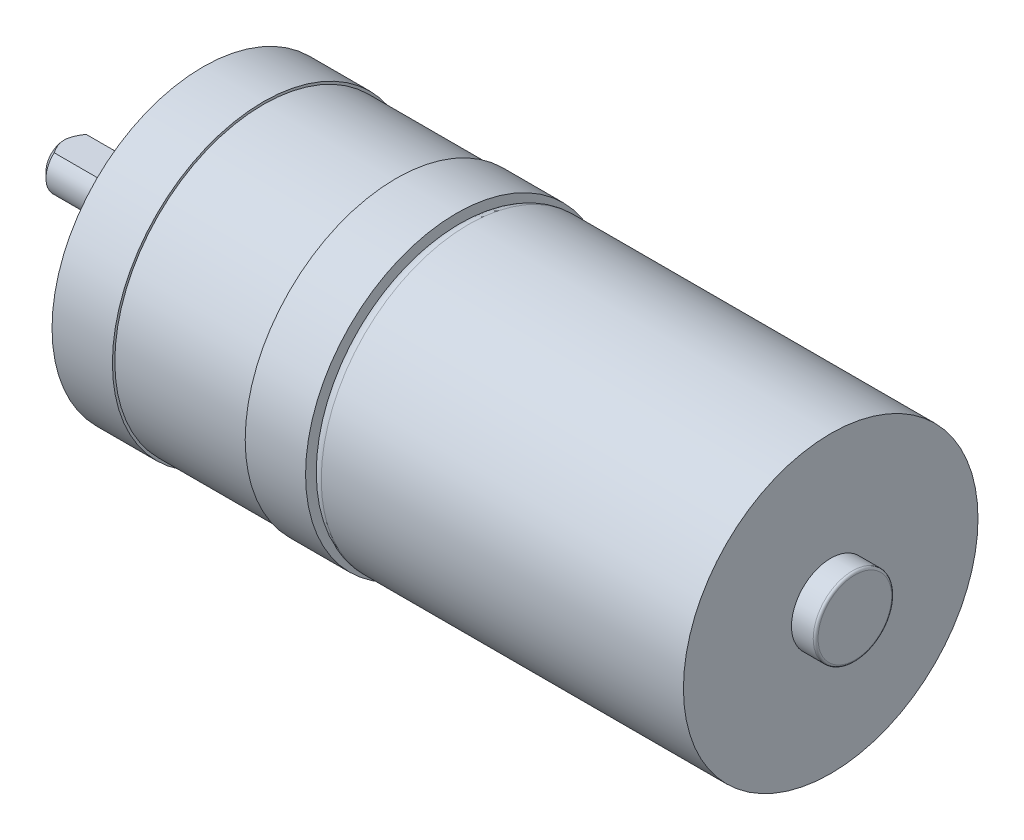
ISO-10303-21;
HEADER;
FILE_DESCRIPTION(('STEP AP214'),'2;1');
FILE_NAME('part.step','',(''),(''),'','','');
FILE_SCHEMA(('AUTOMOTIVE_DESIGN { 1 0 10303 214 1 1 1 1 }'));
ENDSEC;
DATA;
#1=APPLICATION_CONTEXT('core data for automotive mechanical design processes');
#2=APPLICATION_PROTOCOL_DEFINITION('international standard','automotive_design',2000,#1);
#3=PRODUCT_CONTEXT('',#1,'mechanical');
#4=PRODUCT('Part','Part','',(#3));
#5=PRODUCT_RELATED_PRODUCT_CATEGORY('part','',(#4));
#6=PRODUCT_DEFINITION_FORMATION('','',#4);
#7=PRODUCT_DEFINITION_CONTEXT('part definition',#1,'design');
#8=PRODUCT_DEFINITION('design','',#6,#7);
#9=PRODUCT_DEFINITION_SHAPE('','',#8);
#10=(LENGTH_UNIT() NAMED_UNIT(*) SI_UNIT(.MILLI.,.METRE.));
#11=(NAMED_UNIT(*) PLANE_ANGLE_UNIT() SI_UNIT($,.RADIAN.));
#12=(NAMED_UNIT(*) SI_UNIT($,.STERADIAN.) SOLID_ANGLE_UNIT());
#13=UNCERTAINTY_MEASURE_WITH_UNIT(LENGTH_MEASURE(1.E-05),#10,'distance_accuracy_value','');
#14=(GEOMETRIC_REPRESENTATION_CONTEXT(3) GLOBAL_UNCERTAINTY_ASSIGNED_CONTEXT((#13)) GLOBAL_UNIT_ASSIGNED_CONTEXT((#10,
#11,#12)) REPRESENTATION_CONTEXT('',''));
#15=CARTESIAN_POINT('',(0.,0.,0.));
#16=DIRECTION('',(0.,0.,1.));
#17=DIRECTION('',(1.,0.,0.));
#18=AXIS2_PLACEMENT_3D('',#15,#16,#17);
#19=CARTESIAN_POINT('',(-21.4466609261385,0.,0.));
#20=DIRECTION('',(-1.,0.,0.));
#21=DIRECTION('',(0.,0.,1.));
#22=AXIS2_PLACEMENT_3D('',#19,#20,#21);
#23=CYLINDRICAL_SURFACE('',#22,12.5);
#24=CARTESIAN_POINT('',(-4.94666092613853,0.,0.));
#25=DIRECTION('',(-1.,0.,0.));
#26=DIRECTION('',(0.,0.,1.));
#27=AXIS2_PLACEMENT_3D('',#24,#25,#26);
#28=CIRCLE('',#27,12.5);
#29=CARTESIAN_POINT('',(-4.94666092613853,0.,12.5));
#30=VERTEX_POINT('',#29);
#31=EDGE_CURVE('E113',#30,#30,#28,.T.);
#32=ORIENTED_EDGE('',*,*,#31,.T.);
#33=EDGE_LOOP('',(#32));
#34=FACE_BOUND('',#33,.T.);
#35=CARTESIAN_POINT('',(-9.94666092613853,0.,0.));
#36=DIRECTION('',(-1.,0.,0.));
#37=DIRECTION('',(0.,0.,1.));
#38=AXIS2_PLACEMENT_3D('',#35,#36,#37);
#39=CIRCLE('',#38,12.5);
#40=CARTESIAN_POINT('',(-9.94666092613853,0.,12.5));
#41=VERTEX_POINT('',#40);
#42=EDGE_CURVE('E11',#41,#41,#39,.T.);
#43=ORIENTED_EDGE('',*,*,#42,.F.);
#44=EDGE_LOOP('',(#43));
#45=FACE_BOUND('',#44,.T.);
#46=ADVANCED_FACE('F50',(#34,#45),#23,.T.);
#47=CARTESIAN_POINT('',(-9.94666092613853,-3.53165151629512,0.));
#48=DIRECTION('',(-1.,0.,0.));
#49=DIRECTION('',(0.,0.,1.));
#50=AXIS2_PLACEMENT_3D('',#47,#48,#49);
#51=PLANE('',#50);
#52=ORIENTED_EDGE('',*,*,#42,.T.);
#53=EDGE_LOOP('',(#52));
#54=FACE_BOUND('',#53,.T.);
#55=CARTESIAN_POINT('',(-9.94666092613853,0.,0.));
#56=DIRECTION('',(-1.,0.,0.));
#57=DIRECTION('',(0.,0.,1.));
#58=AXIS2_PLACEMENT_3D('',#55,#56,#57);
#59=CIRCLE('',#58,3.53165151629512);
#60=CARTESIAN_POINT('',(-9.94666092613853,0.,3.53165151629512));
#61=VERTEX_POINT('',#60);
#62=EDGE_CURVE('E58',#61,#61,#59,.T.);
#63=ORIENTED_EDGE('',*,*,#62,.F.);
#64=EDGE_LOOP('',(#63));
#65=FACE_BOUND('',#64,.T.);
#66=ADVANCED_FACE('F175',(#54,#65),#51,.T.);
#67=CARTESIAN_POINT('',(-21.4466609261385,0.,0.));
#68=DIRECTION('',(-1.,0.,0.));
#69=DIRECTION('',(0.,0.,1.));
#70=AXIS2_PLACEMENT_3D('',#67,#68,#69);
#71=CYLINDRICAL_SURFACE('',#70,3.53165151629512);
#72=ORIENTED_EDGE('',*,*,#62,.T.);
#73=EDGE_LOOP('',(#72));
#74=FACE_BOUND('',#73,.T.);
#75=CARTESIAN_POINT('',(-12.4466609261385,0.,0.));
#76=DIRECTION('',(-1.,0.,0.));
#77=DIRECTION('',(0.,0.,1.));
#78=AXIS2_PLACEMENT_3D('',#75,#76,#77);
#79=CIRCLE('',#78,3.53165151629512);
#80=CARTESIAN_POINT('',(-12.4466609261385,0.,3.53165151629512));
#81=VERTEX_POINT('',#80);
#82=EDGE_CURVE('E191',#81,#81,#79,.T.);
#83=ORIENTED_EDGE('',*,*,#82,.F.);
#84=EDGE_LOOP('',(#83));
#85=FACE_BOUND('',#84,.T.);
#86=ADVANCED_FACE('F180',(#74,#85),#71,.T.);
#87=CARTESIAN_POINT('',(-12.4466609261385,-2.,0.));
#88=DIRECTION('',(-1.,0.,0.));
#89=DIRECTION('',(0.,0.,1.));
#90=AXIS2_PLACEMENT_3D('',#87,#88,#89);
#91=PLANE('',#90);
#92=ORIENTED_EDGE('',*,*,#82,.T.);
#93=EDGE_LOOP('',(#92));
#94=FACE_BOUND('',#93,.T.);
#95=CARTESIAN_POINT('',(-12.4466609261385,0.,0.));
#96=DIRECTION('',(-1.,0.,0.));
#97=DIRECTION('',(0.,0.,1.));
#98=AXIS2_PLACEMENT_3D('',#95,#96,#97);
#99=CIRCLE('',#98,2.);
#100=CARTESIAN_POINT('',(-12.4466609261385,0.,2.));
#101=VERTEX_POINT('',#100);
#102=EDGE_CURVE('E196',#101,#101,#99,.T.);
#103=ORIENTED_EDGE('',*,*,#102,.F.);
#104=EDGE_LOOP('',(#103));
#105=FACE_BOUND('',#104,.T.);
#106=ADVANCED_FACE('F312',(#94,#105),#91,.T.);
#107=CARTESIAN_POINT('',(-21.4466609261385,0.,0.));
#108=DIRECTION('',(-1.,0.,0.));
#109=DIRECTION('',(0.,0.,1.));
#110=AXIS2_PLACEMENT_3D('',#107,#108,#109);
#111=CYLINDRICAL_SURFACE('',#110,2.);
#112=DIRECTION('',(-1.,0.,0.));
#113=VECTOR('',#112,1.);
#114=CARTESIAN_POINT('',(-13.4466609261385,1.5,1.3228756555323));
#115=LINE('',#114,#113);
#116=CARTESIAN_POINT('',(-13.4466609261385,1.5,1.3228756555323));
#117=VERTEX_POINT('',#116);
#118=CARTESIAN_POINT('',(-20.9466609261385,1.5,1.3228756555323));
#119=VERTEX_POINT('',#118);
#120=EDGE_CURVE('E90',#117,#119,#115,.T.);
#121=ORIENTED_EDGE('',*,*,#120,.T.);
#122=CARTESIAN_POINT('',(-20.9466609261385,0.,0.));
#123=DIRECTION('',(-1.,0.,0.));
#124=DIRECTION('',(0.,0.,1.));
#125=AXIS2_PLACEMENT_3D('',#122,#123,#124);
#126=CIRCLE('',#125,2.);
#127=CARTESIAN_POINT('',(-20.9466609261385,1.5,-1.3228756555323));
#128=VERTEX_POINT('',#127);
#129=EDGE_CURVE('E97',#128,#119,#126,.T.);
#130=ORIENTED_EDGE('',*,*,#129,.F.);
#131=DIRECTION('',(-1.,0.,0.));
#132=VECTOR('',#131,1.);
#133=CARTESIAN_POINT('',(-13.4466609261385,1.5,-1.3228756555323));
#134=LINE('',#133,#132);
#135=CARTESIAN_POINT('',(-13.4466609261385,1.5,-1.3228756555323));
#136=VERTEX_POINT('',#135);
#137=EDGE_CURVE('E89',#136,#128,#134,.T.);
#138=ORIENTED_EDGE('',*,*,#137,.F.);
#139=CARTESIAN_POINT('',(-13.4466609261385,0.,0.));
#140=DIRECTION('',(-1.,0.,0.));
#141=DIRECTION('',(0.,0.,1.));
#142=AXIS2_PLACEMENT_3D('',#139,#140,#141);
#143=CIRCLE('',#142,2.);
#144=EDGE_CURVE('E80',#117,#136,#143,.T.);
#145=ORIENTED_EDGE('',*,*,#144,.F.);
#146=EDGE_LOOP('',(#121,#130,#138,#145));
#147=FACE_BOUND('',#146,.T.);
#148=ORIENTED_EDGE('',*,*,#102,.T.);
#149=EDGE_LOOP('',(#148));
#150=FACE_BOUND('',#149,.T.);
#151=ADVANCED_FACE('F94',(#147,#150),#111,.T.);
#152=CARTESIAN_POINT('',(-21.4466609261385,0.,0.));
#153=DIRECTION('',(1.,0.,0.));
#154=DIRECTION('',(0.,0.,-1.));
#155=AXIS2_PLACEMENT_3D('',#152,#153,#154);
#156=CONICAL_SURFACE('',#155,1.5,0.785398163397448);
#157=CARTESIAN_POINT('',(-18.6599944301756,1.5,-4.01565805909955));
#158=CARTESIAN_POINT('',(-18.7772799339824,1.5,-3.89042013528773));
#159=CARTESIAN_POINT('',(-18.8942447324204,1.5,-3.76487746263411));
#160=CARTESIAN_POINT('',(-19.1272488522695,1.5,-3.51287496184868));
#161=CARTESIAN_POINT('',(-19.2432879191972,1.5,-3.38641489861014));
#162=CARTESIAN_POINT('',(-19.4750754185143,1.5,-3.13125567201492));
#163=CARTESIAN_POINT('',(-19.5908129825144,1.5,-3.00254661249287));
#164=CARTESIAN_POINT('',(-19.8204354842027,1.5,-2.74351946624489));
#165=CARTESIAN_POINT('',(-19.9343207337169,1.5,-2.61320165697772));
#166=CARTESIAN_POINT('',(-20.1398631331694,1.5,-2.37303010342155));
#167=CARTESIAN_POINT('',(-20.2319504655065,1.5,-2.26354611208234));
#168=CARTESIAN_POINT('',(-20.4134720299847,1.5,-2.04231590010789));
#169=CARTESIAN_POINT('',(-20.502905132972,1.5,-1.93056874975612));
#170=CARTESIAN_POINT('',(-20.6775427183617,1.5,-1.70415010582334));
#171=CARTESIAN_POINT('',(-20.7627558893309,1.5,-1.58948542537739));
#172=CARTESIAN_POINT('',(-20.8856244023833,1.5,-1.41406690474835));
#173=CARTESIAN_POINT('',(-20.9257433465697,1.5,-1.3550432048692));
#174=CARTESIAN_POINT('',(-21.0038206647526,1.5,-1.23558919260889));
#175=CARTESIAN_POINT('',(-21.0417794769346,1.5,-1.17515916903174));
#176=CARTESIAN_POINT('',(-21.1079330584043,1.5,-1.06419326243409));
#177=CARTESIAN_POINT('',(-21.1366159684713,1.5,-1.01394977892618));
#178=CARTESIAN_POINT('',(-21.1916094275951,1.5,-0.912163598634599));
#179=CARTESIAN_POINT('',(-21.2179196718334,1.5,-0.860620736003789));
#180=CARTESIAN_POINT('',(-21.2674843606524,1.5,-0.75613647512261));
#181=CARTESIAN_POINT('',(-21.2907422542188,1.5,-0.703196737968753));
#182=CARTESIAN_POINT('',(-21.3334168644819,1.5,-0.595812489744645));
#183=CARTESIAN_POINT('',(-21.3528347074981,1.5,-0.54136842526216));
#184=CARTESIAN_POINT('',(-21.3965857411879,1.5,-0.399362441578788));
#185=CARTESIAN_POINT('',(-21.4174026018075,1.5,-0.310627728461867));
#186=CARTESIAN_POINT('',(-21.4370271007536,1.5,-0.17600485397584));
#187=CARTESIAN_POINT('',(-21.4416363946779,1.5,-0.130926602570022));
#188=CARTESIAN_POINT('',(-21.4467900111874,1.5,-0.0405278937250137));
#189=CARTESIAN_POINT('',(-21.4473344618416,1.5,0.00479255603833192));
#190=CARTESIAN_POINT('',(-21.4443171872065,1.5,0.0953274395539691));
#191=CARTESIAN_POINT('',(-21.4407522873543,1.5,0.140541764268593));
#192=CARTESIAN_POINT('',(-21.4297122542497,1.5,0.230492359752381));
#193=CARTESIAN_POINT('',(-21.422236332384,1.5,0.275228532250461));
#194=CARTESIAN_POINT('',(-21.4037214360982,1.5,0.364085515861556));
#195=CARTESIAN_POINT('',(-21.3926720005498,1.5,0.408204118547307));
#196=CARTESIAN_POINT('',(-21.3674809164456,1.5,0.495536760983926));
#197=CARTESIAN_POINT('',(-21.35333922587,1.5,0.538750788434028));
#198=CARTESIAN_POINT('',(-21.3010753758268,1.5,0.683373717402224));
#199=CARTESIAN_POINT('',(-21.2568457909961,1.5,0.782575044372217));
#200=CARTESIAN_POINT('',(-21.1589248993358,1.5,0.976220616942044));
#201=CARTESIAN_POINT('',(-21.1052128657479,1.5,1.07065384672911));
#202=CARTESIAN_POINT('',(-20.9910249681587,1.5,1.25697315171939));
#203=CARTESIAN_POINT('',(-20.9304707236246,1.5,1.34881059342671));
#204=CARTESIAN_POINT('',(-20.8053465362851,1.5,1.52952998233961));
#205=CARTESIAN_POINT('',(-20.7407807001573,1.5,1.61841481358109));
#206=CARTESIAN_POINT('',(-20.5957213813144,1.5,1.81156206065232));
#207=CARTESIAN_POINT('',(-20.5146162537708,1.5,1.91536246677856));
#208=CARTESIAN_POINT('',(-20.3497178302725,1.5,2.12081369094374));
#209=CARTESIAN_POINT('',(-20.265924131741,1.5,2.2224641832459));
#210=CARTESIAN_POINT('',(-20.0963751354204,1.5,2.42427777545712));
#211=CARTESIAN_POINT('',(-20.0106180247746,1.5,2.52443934729585));
#212=CARTESIAN_POINT('',(-19.8377347485601,1.5,2.72357467383111));
#213=CARTESIAN_POINT('',(-19.7506085499926,1.5,2.82254839979564));
#214=CARTESIAN_POINT('',(-19.5806572523155,1.5,3.01359651876727));
#215=CARTESIAN_POINT('',(-19.4978925037317,1.5,3.10572469788864));
#216=CARTESIAN_POINT('',(-19.3316557364276,1.5,3.289343530319));
#217=CARTESIAN_POINT('',(-19.2481837030317,1.5,3.38083417032726));
#218=CARTESIAN_POINT('',(-19.0808466594457,1.5,3.56312044751085));
#219=CARTESIAN_POINT('',(-18.996982758081,1.5,3.65391710371256));
#220=CARTESIAN_POINT('',(-18.8288030047615,1.5,3.83508406846687));
#221=CARTESIAN_POINT('',(-18.7444871715748,1.5,3.92545439443569));
#222=CARTESIAN_POINT('',(-18.6599944301756,1.5,4.01565805909955));
#223=B_SPLINE_CURVE_WITH_KNOTS('',3,(#157,#158,#159,#160,#161,#162,#163,#164,#165,#166,#167,
#168,#169,#170,#171,#172,#173,#174,#175,#176,#177,#178,#179,#180,#181,#182,#183,#184,#185,#186,
#187,#188,#189,#190,#191,#192,#193,#194,#195,#196,#197,#198,#199,#200,#201,#202,#203,#204,#205,
#206,#207,#208,#209,#210,#211,#212,#213,#214,#215,#216,#217,#218,#219,#220,#221,#222),
.UNSPECIFIED.,.F.,.F.,(4,2,2,2,2,2,2,2,2,2,2,2,2,2,2,2,2,2,2,2,2,2,2,2,2,2,2,2,2,2,2,2,4),(0.,
0.514750699468764,1.02963833852691,1.54890574576718,2.06808481331768,2.49724068126467,
2.92657657581786,3.35498823243659,3.56905741024268,3.78308300790428,3.95659551745444,
4.13013028665268,4.30346725130455,4.47675329909123,4.74890512459737,4.8846880297537,
5.02046665684716,5.15635024622355,5.2922612455528,5.42857376872477,5.5648881443249,
5.88980547741524,6.2154420130272,6.54528321670252,6.87479215354149,7.2699099426123,
7.66508717383951,8.06064529972853,8.45621297429788,8.82774376861426,9.19928229096719,
9.57008337714151,9.94086918203867),.UNSPECIFIED.);
#224=CARTESIAN_POINT('',(-21.4466609261385,1.5,0.));
#225=VERTEX_POINT('',#224);
#226=EDGE_CURVE('E65',#128,#225,#223,.T.);
#227=ORIENTED_EDGE('',*,*,#226,.F.);
#228=ORIENTED_EDGE('',*,*,#129,.T.);
#229=EDGE_CURVE('E69',#225,#119,#223,.T.);
#230=ORIENTED_EDGE('',*,*,#229,.F.);
#231=CARTESIAN_POINT('',(-21.4466609261385,0.,0.));
#232=DIRECTION('',(-1.,0.,0.));
#233=DIRECTION('',(0.,0.,1.));
#234=AXIS2_PLACEMENT_3D('',#231,#232,#233);
#235=CIRCLE('',#234,1.5);
#236=EDGE_CURVE('E204',#225,#225,#235,.T.);
#237=ORIENTED_EDGE('',*,*,#236,.F.);
#238=EDGE_LOOP('',(#227,#228,#230,#237));
#239=FACE_BOUND('',#238,.T.);
#240=ADVANCED_FACE('F115',(#239),#156,.T.);
#241=CARTESIAN_POINT('',(-21.4466609261385,0.,0.));
#242=DIRECTION('',(-1.,0.,0.));
#243=DIRECTION('',(0.,0.,1.));
#244=AXIS2_PLACEMENT_3D('',#241,#242,#243);
#245=PLANE('',#244);
#246=ORIENTED_EDGE('',*,*,#236,.T.);
#247=EDGE_LOOP('',(#246));
#248=FACE_BOUND('',#247,.T.);
#249=ADVANCED_FACE('F165',(#248),#245,.T.);
#250=CARTESIAN_POINT('',(44.0533390738615,-3.05,0.));
#251=DIRECTION('',(1.,0.,0.));
#252=DIRECTION('',(0.,0.,-1.));
#253=AXIS2_PLACEMENT_3D('',#250,#251,#252);
#254=PLANE('',#253);
#255=CARTESIAN_POINT('',(44.0533390738615,0.,0.));
#256=DIRECTION('',(-1.,0.,0.));
#257=DIRECTION('',(0.,0.,1.));
#258=AXIS2_PLACEMENT_3D('',#255,#256,#257);
#259=CIRCLE('',#258,3.05);
#260=CARTESIAN_POINT('',(44.0533390738615,0.,3.05));
#261=VERTEX_POINT('',#260);
#262=EDGE_CURVE('E207',#261,#261,#259,.T.);
#263=ORIENTED_EDGE('',*,*,#262,.F.);
#264=EDGE_LOOP('',(#263));
#265=FACE_BOUND('',#264,.T.);
#266=ADVANCED_FACE('F162',(#265),#254,.T.);
#267=CARTESIAN_POINT('',(43.8533390738615,0.,0.));
#268=DIRECTION('',(-1.,0.,0.));
#269=DIRECTION('',(0.,0.,1.));
#270=AXIS2_PLACEMENT_3D('',#267,#268,#269);
#271=TOROIDAL_SURFACE('',#270,3.05,0.199999999999999);
#272=ORIENTED_EDGE('',*,*,#262,.T.);
#273=EDGE_LOOP('',(#272));
#274=FACE_BOUND('',#273,.T.);
#275=CARTESIAN_POINT('',(43.8533390738615,0.,0.));
#276=DIRECTION('',(-1.,0.,0.));
#277=DIRECTION('',(0.,0.,1.));
#278=AXIS2_PLACEMENT_3D('',#275,#276,#277);
#279=CIRCLE('',#278,3.25);
#280=CARTESIAN_POINT('',(43.8533390738615,0.,3.25));
#281=VERTEX_POINT('',#280);
#282=EDGE_CURVE('E211',#281,#281,#279,.T.);
#283=ORIENTED_EDGE('',*,*,#282,.F.);
#284=EDGE_LOOP('',(#283));
#285=FACE_BOUND('',#284,.T.);
#286=ADVANCED_FACE('F158',(#274,#285),#271,.T.);
#287=CARTESIAN_POINT('',(-21.4466609261385,0.,0.));
#288=DIRECTION('',(-1.,0.,0.));
#289=DIRECTION('',(0.,0.,1.));
#290=AXIS2_PLACEMENT_3D('',#287,#288,#289);
#291=CYLINDRICAL_SURFACE('',#290,3.25);
#292=ORIENTED_EDGE('',*,*,#282,.T.);
#293=EDGE_LOOP('',(#292));
#294=FACE_BOUND('',#293,.T.);
#295=CARTESIAN_POINT('',(42.0533390738615,0.,0.));
#296=DIRECTION('',(-1.,0.,0.));
#297=DIRECTION('',(0.,0.,1.));
#298=AXIS2_PLACEMENT_3D('',#295,#296,#297);
#299=CIRCLE('',#298,3.25);
#300=CARTESIAN_POINT('',(42.0533390738615,0.,3.25));
#301=VERTEX_POINT('',#300);
#302=EDGE_CURVE('E215',#301,#301,#299,.T.);
#303=ORIENTED_EDGE('',*,*,#302,.F.);
#304=EDGE_LOOP('',(#303));
#305=FACE_BOUND('',#304,.T.);
#306=ADVANCED_FACE('F154',(#294,#305),#291,.T.);
#307=CARTESIAN_POINT('',(42.0533390738615,-12.2,0.));
#308=DIRECTION('',(1.,0.,0.));
#309=DIRECTION('',(0.,0.,-1.));
#310=AXIS2_PLACEMENT_3D('',#307,#308,#309);
#311=PLANE('',#310);
#312=ORIENTED_EDGE('',*,*,#302,.T.);
#313=EDGE_LOOP('',(#312));
#314=FACE_BOUND('',#313,.T.);
#315=CARTESIAN_POINT('',(42.0533390738615,0.,0.));
#316=DIRECTION('',(-1.,0.,0.));
#317=DIRECTION('',(0.,0.,1.));
#318=AXIS2_PLACEMENT_3D('',#315,#316,#317);
#319=CIRCLE('',#318,12.2);
#320=CARTESIAN_POINT('',(42.0533390738615,0.,12.2));
#321=VERTEX_POINT('',#320);
#322=EDGE_CURVE('E219',#321,#321,#319,.T.);
#323=ORIENTED_EDGE('',*,*,#322,.F.);
#324=EDGE_LOOP('',(#323));
#325=FACE_BOUND('',#324,.T.);
#326=ADVANCED_FACE('F150',(#314,#325),#311,.T.);
#327=CARTESIAN_POINT('',(-21.4466609261385,0.,0.));
#328=DIRECTION('',(-1.,0.,0.));
#329=DIRECTION('',(0.,0.,1.));
#330=AXIS2_PLACEMENT_3D('',#327,#328,#329);
#331=CYLINDRICAL_SURFACE('',#330,12.2);
#332=ORIENTED_EDGE('',*,*,#322,.T.);
#333=EDGE_LOOP('',(#332));
#334=FACE_BOUND('',#333,.T.);
#335=CARTESIAN_POINT('',(12.0533390738614,0.,0.));
#336=DIRECTION('',(-1.,0.,0.));
#337=DIRECTION('',(0.,0.,1.));
#338=AXIS2_PLACEMENT_3D('',#335,#336,#337);
#339=CIRCLE('',#338,12.2);
#340=CARTESIAN_POINT('',(12.0533390738614,0.,12.2));
#341=VERTEX_POINT('',#340);
#342=EDGE_CURVE('E223',#341,#341,#339,.T.);
#343=ORIENTED_EDGE('',*,*,#342,.F.);
#344=EDGE_LOOP('',(#343));
#345=FACE_BOUND('',#344,.T.);
#346=ADVANCED_FACE('F146',(#334,#345),#331,.T.);
#347=CARTESIAN_POINT('',(12.0533390738614,0.,0.));
#348=DIRECTION('',(-1.,0.,0.));
#349=DIRECTION('',(0.,0.,1.));
#350=AXIS2_PLACEMENT_3D('',#347,#348,#349);
#351=TOROIDAL_SURFACE('',#350,11.2,1.);
#352=ORIENTED_EDGE('',*,*,#342,.T.);
#353=EDGE_LOOP('',(#352));
#354=FACE_BOUND('',#353,.T.);
#355=CARTESIAN_POINT('',(11.0533390738614,0.,0.));
#356=DIRECTION('',(-1.,0.,0.));
#357=DIRECTION('',(0.,0.,1.));
#358=AXIS2_PLACEMENT_3D('',#355,#356,#357);
#359=CIRCLE('',#358,11.2);
#360=CARTESIAN_POINT('',(11.0533390738614,0.,11.2));
#361=VERTEX_POINT('',#360);
#362=EDGE_CURVE('E227',#361,#361,#359,.T.);
#363=ORIENTED_EDGE('',*,*,#362,.F.);
#364=EDGE_LOOP('',(#363));
#365=FACE_BOUND('',#364,.T.);
#366=ADVANCED_FACE('F142',(#354,#365),#351,.T.);
#367=CARTESIAN_POINT('',(11.0533390738615,-11.2,0.));
#368=DIRECTION('',(1.,0.,0.));
#369=DIRECTION('',(0.,0.,-1.));
#370=AXIS2_PLACEMENT_3D('',#367,#368,#369);
#371=PLANE('',#370);
#372=ORIENTED_EDGE('',*,*,#362,.T.);
#373=EDGE_LOOP('',(#372));
#374=FACE_BOUND('',#373,.T.);
#375=CARTESIAN_POINT('',(11.0533390738615,0.,0.));
#376=DIRECTION('',(-1.,0.,0.));
#377=DIRECTION('',(0.,0.,1.));
#378=AXIS2_PLACEMENT_3D('',#375,#376,#377);
#379=CIRCLE('',#378,12.5);
#380=CARTESIAN_POINT('',(11.0533390738615,0.,12.5));
#381=VERTEX_POINT('',#380);
#382=EDGE_CURVE('E231',#381,#381,#379,.T.);
#383=ORIENTED_EDGE('',*,*,#382,.F.);
#384=EDGE_LOOP('',(#383));
#385=FACE_BOUND('',#384,.T.);
#386=ADVANCED_FACE('F138',(#374,#385),#371,.T.);
#387=CARTESIAN_POINT('',(-21.4466609261385,0.,0.));
#388=DIRECTION('',(-1.,0.,0.));
#389=DIRECTION('',(0.,0.,1.));
#390=AXIS2_PLACEMENT_3D('',#387,#388,#389);
#391=CYLINDRICAL_SURFACE('',#390,12.5);
#392=ORIENTED_EDGE('',*,*,#382,.T.);
#393=EDGE_LOOP('',(#392));
#394=FACE_BOUND('',#393,.T.);
#395=CARTESIAN_POINT('',(6.05333907386146,0.,0.));
#396=DIRECTION('',(-1.,0.,0.));
#397=DIRECTION('',(0.,0.,1.));
#398=AXIS2_PLACEMENT_3D('',#395,#396,#397);
#399=CIRCLE('',#398,12.5);
#400=CARTESIAN_POINT('',(6.05333907386146,0.,12.5));
#401=VERTEX_POINT('',#400);
#402=EDGE_CURVE('E235',#401,#401,#399,.T.);
#403=ORIENTED_EDGE('',*,*,#402,.F.);
#404=EDGE_LOOP('',(#403));
#405=FACE_BOUND('',#404,.T.);
#406=ADVANCED_FACE('F134',(#394,#405),#391,.T.);
#407=CARTESIAN_POINT('',(6.05333907386146,-12.3,0.));
#408=DIRECTION('',(-1.,0.,0.));
#409=DIRECTION('',(0.,0.,1.));
#410=AXIS2_PLACEMENT_3D('',#407,#408,#409);
#411=PLANE('',#410);
#412=ORIENTED_EDGE('',*,*,#402,.T.);
#413=EDGE_LOOP('',(#412));
#414=FACE_BOUND('',#413,.T.);
#415=CARTESIAN_POINT('',(6.05333907386146,0.,0.));
#416=DIRECTION('',(-1.,0.,0.));
#417=DIRECTION('',(0.,0.,1.));
#418=AXIS2_PLACEMENT_3D('',#415,#416,#417);
#419=CIRCLE('',#418,12.3);
#420=CARTESIAN_POINT('',(6.05333907386146,0.,12.3));
#421=VERTEX_POINT('',#420);
#422=EDGE_CURVE('E239',#421,#421,#419,.T.);
#423=ORIENTED_EDGE('',*,*,#422,.F.);
#424=EDGE_LOOP('',(#423));
#425=FACE_BOUND('',#424,.T.);
#426=ADVANCED_FACE('F130',(#414,#425),#411,.T.);
#427=CARTESIAN_POINT('',(-21.4466609261385,0.,0.));
#428=DIRECTION('',(-1.,0.,0.));
#429=DIRECTION('',(0.,0.,1.));
#430=AXIS2_PLACEMENT_3D('',#427,#428,#429);
#431=CYLINDRICAL_SURFACE('',#430,12.3);
#432=ORIENTED_EDGE('',*,*,#422,.T.);
#433=EDGE_LOOP('',(#432));
#434=FACE_BOUND('',#433,.T.);
#435=CARTESIAN_POINT('',(-4.94666092613853,0.,0.));
#436=DIRECTION('',(-1.,0.,0.));
#437=DIRECTION('',(0.,0.,1.));
#438=AXIS2_PLACEMENT_3D('',#435,#436,#437);
#439=CIRCLE('',#438,12.3);
#440=CARTESIAN_POINT('',(-4.94666092613853,0.,12.3));
#441=VERTEX_POINT('',#440);
#442=EDGE_CURVE('E242',#441,#441,#439,.T.);
#443=ORIENTED_EDGE('',*,*,#442,.F.);
#444=EDGE_LOOP('',(#443));
#445=FACE_BOUND('',#444,.T.);
#446=ADVANCED_FACE('F126',(#434,#445),#431,.T.);
#447=CARTESIAN_POINT('',(-4.94666092613853,-12.3,0.));
#448=DIRECTION('',(1.,0.,0.));
#449=DIRECTION('',(0.,0.,-1.));
#450=AXIS2_PLACEMENT_3D('',#447,#448,#449);
#451=PLANE('',#450);
#452=ORIENTED_EDGE('',*,*,#442,.T.);
#453=EDGE_LOOP('',(#452));
#454=FACE_BOUND('',#453,.T.);
#455=ORIENTED_EDGE('',*,*,#31,.F.);
#456=EDGE_LOOP('',(#455));
#457=FACE_BOUND('',#456,.T.);
#458=ADVANCED_FACE('F123',(#454,#457),#451,.T.);
#459=CARTESIAN_POINT('',(-13.4466609261385,1.5,-1.3228756555323));
#460=DIRECTION('',(0.,-1.,0.));
#461=DIRECTION('',(0.,0.,-1.));
#462=AXIS2_PLACEMENT_3D('',#459,#460,#461);
#463=PLANE('',#462);
#464=ORIENTED_EDGE('',*,*,#226,.T.);
#465=ORIENTED_EDGE('',*,*,#229,.T.);
#466=ORIENTED_EDGE('',*,*,#120,.F.);
#467=DIRECTION('',(0.,0.,1.));
#468=VECTOR('',#467,1.);
#469=CARTESIAN_POINT('',(-13.4466609261385,1.5,-1.3228756555323));
#470=LINE('',#469,#468);
#471=EDGE_CURVE('E83',#136,#117,#470,.T.);
#472=ORIENTED_EDGE('',*,*,#471,.F.);
#473=ORIENTED_EDGE('',*,*,#137,.T.);
#474=EDGE_LOOP('',(#464,#465,#466,#472,#473));
#475=FACE_BOUND('',#474,.T.);
#476=ADVANCED_FACE('F88',(#475),#463,.F.);
#477=CARTESIAN_POINT('',(-13.4466609261385,0.,0.));
#478=DIRECTION('',(-1.,0.,0.));
#479=DIRECTION('',(0.,0.,1.));
#480=AXIS2_PLACEMENT_3D('',#477,#478,#479);
#481=PLANE('',#480);
#482=ORIENTED_EDGE('',*,*,#144,.T.);
#483=ORIENTED_EDGE('',*,*,#471,.T.);
#484=EDGE_LOOP('',(#482,#483));
#485=FACE_BOUND('',#484,.T.);
#486=ADVANCED_FACE('F82',(#485),#481,.T.);
#487=CLOSED_SHELL('',(#46,#66,#86,#106,#151,#240,#249,#266,#286,#306,#326,#346,#366,#386,#406,
#426,#446,#458,#476,#486));
#488=MANIFOLD_SOLID_BREP('B2',#487);
#489=ADVANCED_BREP_SHAPE_REPRESENTATION('',(#18,#488),#14);
#490=SHAPE_DEFINITION_REPRESENTATION(#9,#489);
ENDSEC;
END-ISO-10303-21;
